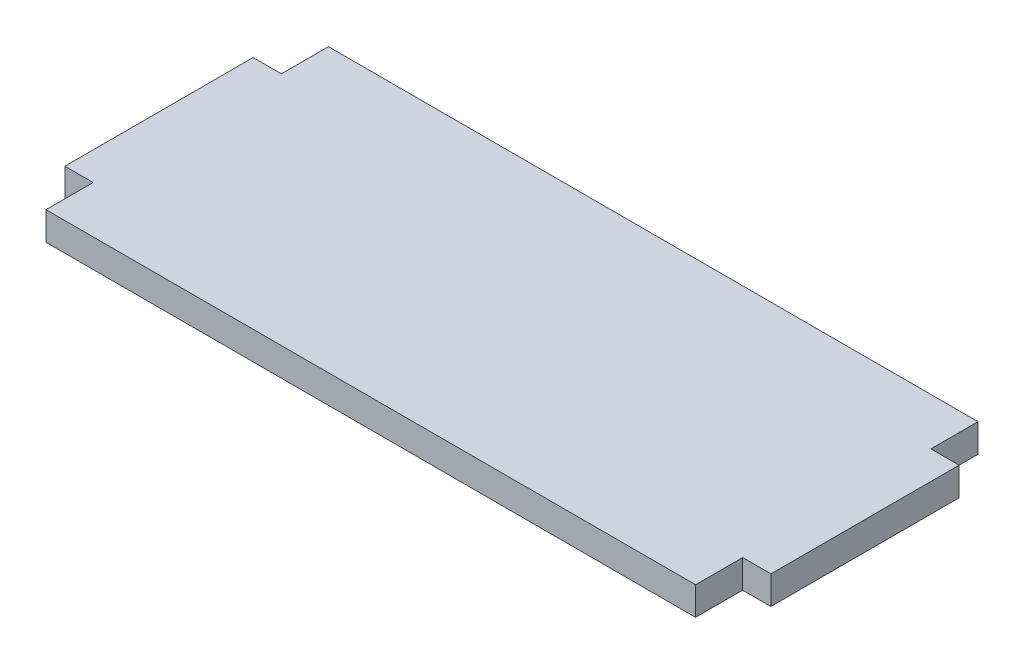
ISO-10303-21;
HEADER;
FILE_DESCRIPTION(('STEP AP214'),'2;1');
FILE_NAME('part.step','',(''),(''),'','','');
FILE_SCHEMA(('AUTOMOTIVE_DESIGN { 1 0 10303 214 1 1 1 1 }'));
ENDSEC;
DATA;
#1=APPLICATION_CONTEXT('core data for automotive mechanical design processes');
#2=APPLICATION_PROTOCOL_DEFINITION('international standard','automotive_design',2000,#1);
#3=PRODUCT_CONTEXT('',#1,'mechanical');
#4=PRODUCT('Part','Part','',(#3));
#5=PRODUCT_RELATED_PRODUCT_CATEGORY('part','',(#4));
#6=PRODUCT_DEFINITION_FORMATION('','',#4);
#7=PRODUCT_DEFINITION_CONTEXT('part definition',#1,'design');
#8=PRODUCT_DEFINITION('design','',#6,#7);
#9=PRODUCT_DEFINITION_SHAPE('','',#8);
#10=(LENGTH_UNIT() NAMED_UNIT(*) SI_UNIT(.MILLI.,.METRE.));
#11=(NAMED_UNIT(*) PLANE_ANGLE_UNIT() SI_UNIT($,.RADIAN.));
#12=(NAMED_UNIT(*) SI_UNIT($,.STERADIAN.) SOLID_ANGLE_UNIT());
#13=UNCERTAINTY_MEASURE_WITH_UNIT(LENGTH_MEASURE(1.E-05),#10,'distance_accuracy_value','');
#14=(GEOMETRIC_REPRESENTATION_CONTEXT(3) GLOBAL_UNCERTAINTY_ASSIGNED_CONTEXT((#13)) GLOBAL_UNIT_ASSIGNED_CONTEXT((#10,
#11,#12)) REPRESENTATION_CONTEXT('',''));
#15=CARTESIAN_POINT('',(0.,0.,0.));
#16=DIRECTION('',(0.,0.,1.));
#17=DIRECTION('',(1.,0.,0.));
#18=AXIS2_PLACEMENT_3D('',#15,#16,#17);
#19=CARTESIAN_POINT('',(69.,3.,-5.));
#20=DIRECTION('',(0.,0.,-1.));
#21=DIRECTION('',(-1.,0.,0.));
#22=AXIS2_PLACEMENT_3D('',#19,#20,#21);
#23=PLANE('',#22);
#24=DIRECTION('',(1.,0.,0.));
#25=VECTOR('',#24,1.);
#26=CARTESIAN_POINT('',(69.,0.,-5.));
#27=LINE('',#26,#25);
#28=CARTESIAN_POINT('',(69.,0.,-5.));
#29=VERTEX_POINT('',#28);
#30=CARTESIAN_POINT('',(72.,0.,-5.));
#31=VERTEX_POINT('',#30);
#32=EDGE_CURVE('E162',#29,#31,#27,.T.);
#33=ORIENTED_EDGE('',*,*,#32,.T.);
#34=DIRECTION('',(0.,-1.,0.));
#35=VECTOR('',#34,1.);
#36=CARTESIAN_POINT('',(72.,3.,-5.));
#37=LINE('',#36,#35);
#38=CARTESIAN_POINT('',(72.,3.,-5.));
#39=VERTEX_POINT('',#38);
#40=EDGE_CURVE('E11',#39,#31,#37,.T.);
#41=ORIENTED_EDGE('',*,*,#40,.F.);
#42=DIRECTION('',(1.,0.,0.));
#43=VECTOR('',#42,1.);
#44=CARTESIAN_POINT('',(69.,3.,-5.));
#45=LINE('',#44,#43);
#46=CARTESIAN_POINT('',(69.,3.,-5.));
#47=VERTEX_POINT('',#46);
#48=EDGE_CURVE('E106',#47,#39,#45,.T.);
#49=ORIENTED_EDGE('',*,*,#48,.F.);
#50=DIRECTION('',(0.,-1.,0.));
#51=VECTOR('',#50,1.);
#52=CARTESIAN_POINT('',(69.,3.,-5.));
#53=LINE('',#52,#51);
#54=EDGE_CURVE('E56',#47,#29,#53,.T.);
#55=ORIENTED_EDGE('',*,*,#54,.T.);
#56=EDGE_LOOP('',(#33,#41,#49,#55));
#57=FACE_BOUND('',#56,.T.);
#58=ADVANCED_FACE('F39',(#57),#23,.F.);
#59=CARTESIAN_POINT('',(72.,3.,-25.));
#60=DIRECTION('',(1.,0.,0.));
#61=DIRECTION('',(0.,0.,-1.));
#62=AXIS2_PLACEMENT_3D('',#59,#60,#61);
#63=PLANE('',#62);
#64=DIRECTION('',(0.,0.,1.));
#65=VECTOR('',#64,1.);
#66=CARTESIAN_POINT('',(72.,0.,-25.));
#67=LINE('',#66,#65);
#68=CARTESIAN_POINT('',(72.,0.,-25.));
#69=VERTEX_POINT('',#68);
#70=EDGE_CURVE('E165',#69,#31,#67,.T.);
#71=ORIENTED_EDGE('',*,*,#70,.F.);
#72=DIRECTION('',(0.,-1.,0.));
#73=VECTOR('',#72,1.);
#74=CARTESIAN_POINT('',(72.,3.,-25.));
#75=LINE('',#74,#73);
#76=CARTESIAN_POINT('',(72.,3.,-25.));
#77=VERTEX_POINT('',#76);
#78=EDGE_CURVE('E48',#77,#69,#75,.T.);
#79=ORIENTED_EDGE('',*,*,#78,.F.);
#80=DIRECTION('',(0.,0.,1.));
#81=VECTOR('',#80,1.);
#82=CARTESIAN_POINT('',(72.,3.,-25.));
#83=LINE('',#82,#81);
#84=EDGE_CURVE('E254',#77,#39,#83,.T.);
#85=ORIENTED_EDGE('',*,*,#84,.T.);
#86=ORIENTED_EDGE('',*,*,#40,.T.);
#87=EDGE_LOOP('',(#71,#79,#85,#86));
#88=FACE_BOUND('',#87,.T.);
#89=ADVANCED_FACE('F239',(#88),#63,.T.);
#90=CARTESIAN_POINT('',(69.,3.,-25.));
#91=DIRECTION('',(0.,0.,-1.));
#92=DIRECTION('',(-1.,0.,0.));
#93=AXIS2_PLACEMENT_3D('',#90,#91,#92);
#94=PLANE('',#93);
#95=DIRECTION('',(1.,0.,0.));
#96=VECTOR('',#95,1.);
#97=CARTESIAN_POINT('',(69.,0.,-25.));
#98=LINE('',#97,#96);
#99=CARTESIAN_POINT('',(69.,0.,-25.));
#100=VERTEX_POINT('',#99);
#101=EDGE_CURVE('E169',#100,#69,#98,.T.);
#102=ORIENTED_EDGE('',*,*,#101,.F.);
#103=DIRECTION('',(0.,-1.,0.));
#104=VECTOR('',#103,1.);
#105=CARTESIAN_POINT('',(69.,3.,-25.));
#106=LINE('',#105,#104);
#107=CARTESIAN_POINT('',(69.,3.,-25.));
#108=VERTEX_POINT('',#107);
#109=EDGE_CURVE('E227',#108,#100,#106,.T.);
#110=ORIENTED_EDGE('',*,*,#109,.F.);
#111=DIRECTION('',(1.,0.,0.));
#112=VECTOR('',#111,1.);
#113=CARTESIAN_POINT('',(69.,3.,-25.));
#114=LINE('',#113,#112);
#115=EDGE_CURVE('E236',#108,#77,#114,.T.);
#116=ORIENTED_EDGE('',*,*,#115,.T.);
#117=ORIENTED_EDGE('',*,*,#78,.T.);
#118=EDGE_LOOP('',(#102,#110,#116,#117));
#119=FACE_BOUND('',#118,.T.);
#120=ADVANCED_FACE('F234',(#119),#94,.T.);
#121=CARTESIAN_POINT('',(69.,3.,-25.));
#122=DIRECTION('',(-1.,0.,0.));
#123=DIRECTION('',(0.,0.,1.));
#124=AXIS2_PLACEMENT_3D('',#121,#122,#123);
#125=PLANE('',#124);
#126=DIRECTION('',(0.,0.,-1.));
#127=VECTOR('',#126,1.);
#128=CARTESIAN_POINT('',(69.,0.,-25.));
#129=LINE('',#128,#127);
#130=CARTESIAN_POINT('',(69.,0.,-30.));
#131=VERTEX_POINT('',#130);
#132=EDGE_CURVE('E173',#100,#131,#129,.T.);
#133=ORIENTED_EDGE('',*,*,#132,.T.);
#134=DIRECTION('',(0.,-1.,0.));
#135=VECTOR('',#134,1.);
#136=CARTESIAN_POINT('',(69.,3.,-30.));
#137=LINE('',#136,#135);
#138=CARTESIAN_POINT('',(69.,3.,-30.));
#139=VERTEX_POINT('',#138);
#140=EDGE_CURVE('E224',#139,#131,#137,.T.);
#141=ORIENTED_EDGE('',*,*,#140,.F.);
#142=DIRECTION('',(0.,0.,-1.));
#143=VECTOR('',#142,1.);
#144=CARTESIAN_POINT('',(69.,3.,-25.));
#145=LINE('',#144,#143);
#146=EDGE_CURVE('E249',#108,#139,#145,.T.);
#147=ORIENTED_EDGE('',*,*,#146,.F.);
#148=ORIENTED_EDGE('',*,*,#109,.T.);
#149=EDGE_LOOP('',(#133,#141,#147,#148));
#150=FACE_BOUND('',#149,.T.);
#151=ADVANCED_FACE('F246',(#150),#125,.F.);
#152=CARTESIAN_POINT('',(0.,3.,-30.));
#153=DIRECTION('',(0.,0.,-1.));
#154=DIRECTION('',(-1.,0.,0.));
#155=AXIS2_PLACEMENT_3D('',#152,#153,#154);
#156=PLANE('',#155);
#157=DIRECTION('',(1.,0.,0.));
#158=VECTOR('',#157,1.);
#159=CARTESIAN_POINT('',(0.,0.,-30.));
#160=LINE('',#159,#158);
#161=CARTESIAN_POINT('',(0.,0.,-30.));
#162=VERTEX_POINT('',#161);
#163=EDGE_CURVE('E177',#162,#131,#160,.T.);
#164=ORIENTED_EDGE('',*,*,#163,.F.);
#165=DIRECTION('',(0.,-1.,0.));
#166=VECTOR('',#165,1.);
#167=CARTESIAN_POINT('',(0.,3.,-30.));
#168=LINE('',#167,#166);
#169=CARTESIAN_POINT('',(0.,3.,-30.));
#170=VERTEX_POINT('',#169);
#171=EDGE_CURVE('E221',#170,#162,#168,.T.);
#172=ORIENTED_EDGE('',*,*,#171,.F.);
#173=DIRECTION('',(1.,0.,0.));
#174=VECTOR('',#173,1.);
#175=CARTESIAN_POINT('',(0.,3.,-30.));
#176=LINE('',#175,#174);
#177=EDGE_CURVE('E252',#170,#139,#176,.T.);
#178=ORIENTED_EDGE('',*,*,#177,.T.);
#179=ORIENTED_EDGE('',*,*,#140,.T.);
#180=EDGE_LOOP('',(#164,#172,#178,#179));
#181=FACE_BOUND('',#180,.T.);
#182=ADVANCED_FACE('F300',(#181),#156,.T.);
#183=CARTESIAN_POINT('',(0.,3.,-25.));
#184=DIRECTION('',(-1.,0.,0.));
#185=DIRECTION('',(0.,0.,1.));
#186=AXIS2_PLACEMENT_3D('',#183,#184,#185);
#187=PLANE('',#186);
#188=DIRECTION('',(0.,0.,-1.));
#189=VECTOR('',#188,1.);
#190=CARTESIAN_POINT('',(0.,0.,-25.));
#191=LINE('',#190,#189);
#192=CARTESIAN_POINT('',(0.,0.,-25.));
#193=VERTEX_POINT('',#192);
#194=EDGE_CURVE('E181',#193,#162,#191,.T.);
#195=ORIENTED_EDGE('',*,*,#194,.F.);
#196=DIRECTION('',(0.,-1.,0.));
#197=VECTOR('',#196,1.);
#198=CARTESIAN_POINT('',(0.,3.,-25.));
#199=LINE('',#198,#197);
#200=CARTESIAN_POINT('',(0.,3.,-25.));
#201=VERTEX_POINT('',#200);
#202=EDGE_CURVE('E218',#201,#193,#199,.T.);
#203=ORIENTED_EDGE('',*,*,#202,.F.);
#204=DIRECTION('',(0.,0.,-1.));
#205=VECTOR('',#204,1.);
#206=CARTESIAN_POINT('',(0.,3.,-25.));
#207=LINE('',#206,#205);
#208=EDGE_CURVE('E263',#201,#170,#207,.T.);
#209=ORIENTED_EDGE('',*,*,#208,.T.);
#210=ORIENTED_EDGE('',*,*,#171,.T.);
#211=EDGE_LOOP('',(#195,#203,#209,#210));
#212=FACE_BOUND('',#211,.T.);
#213=ADVANCED_FACE('F303',(#212),#187,.T.);
#214=CARTESIAN_POINT('',(0.,3.,-25.));
#215=DIRECTION('',(0.,0.,1.));
#216=DIRECTION('',(1.,0.,0.));
#217=AXIS2_PLACEMENT_3D('',#214,#215,#216);
#218=PLANE('',#217);
#219=DIRECTION('',(-1.,0.,0.));
#220=VECTOR('',#219,1.);
#221=CARTESIAN_POINT('',(0.,0.,-25.));
#222=LINE('',#221,#220);
#223=CARTESIAN_POINT('',(-3.,0.,-25.));
#224=VERTEX_POINT('',#223);
#225=EDGE_CURVE('E185',#193,#224,#222,.T.);
#226=ORIENTED_EDGE('',*,*,#225,.T.);
#227=DIRECTION('',(0.,-1.,0.));
#228=VECTOR('',#227,1.);
#229=CARTESIAN_POINT('',(-3.,3.,-25.));
#230=LINE('',#229,#228);
#231=CARTESIAN_POINT('',(-3.,3.,-25.));
#232=VERTEX_POINT('',#231);
#233=EDGE_CURVE('E214',#232,#224,#230,.T.);
#234=ORIENTED_EDGE('',*,*,#233,.F.);
#235=DIRECTION('',(-1.,0.,0.));
#236=VECTOR('',#235,1.);
#237=CARTESIAN_POINT('',(0.,3.,-25.));
#238=LINE('',#237,#236);
#239=EDGE_CURVE('E267',#201,#232,#238,.T.);
#240=ORIENTED_EDGE('',*,*,#239,.F.);
#241=ORIENTED_EDGE('',*,*,#202,.T.);
#242=EDGE_LOOP('',(#226,#234,#240,#241));
#243=FACE_BOUND('',#242,.T.);
#244=ADVANCED_FACE('F307',(#243),#218,.F.);
#245=CARTESIAN_POINT('',(-3.,3.,-25.));
#246=DIRECTION('',(1.,0.,0.));
#247=DIRECTION('',(0.,0.,-1.));
#248=AXIS2_PLACEMENT_3D('',#245,#246,#247);
#249=PLANE('',#248);
#250=DIRECTION('',(0.,0.,1.));
#251=VECTOR('',#250,1.);
#252=CARTESIAN_POINT('',(-3.,0.,-25.));
#253=LINE('',#252,#251);
#254=CARTESIAN_POINT('',(-3.,0.,-5.));
#255=VERTEX_POINT('',#254);
#256=EDGE_CURVE('E188',#224,#255,#253,.T.);
#257=ORIENTED_EDGE('',*,*,#256,.T.);
#258=DIRECTION('',(0.,-1.,0.));
#259=VECTOR('',#258,1.);
#260=CARTESIAN_POINT('',(-3.,3.,-5.));
#261=LINE('',#260,#259);
#262=CARTESIAN_POINT('',(-3.,3.,-5.));
#263=VERTEX_POINT('',#262);
#264=EDGE_CURVE('E211',#263,#255,#261,.T.);
#265=ORIENTED_EDGE('',*,*,#264,.F.);
#266=DIRECTION('',(0.,0.,1.));
#267=VECTOR('',#266,1.);
#268=CARTESIAN_POINT('',(-3.,3.,-25.));
#269=LINE('',#268,#267);
#270=EDGE_CURVE('E270',#232,#263,#269,.T.);
#271=ORIENTED_EDGE('',*,*,#270,.F.);
#272=ORIENTED_EDGE('',*,*,#233,.T.);
#273=EDGE_LOOP('',(#257,#265,#271,#272));
#274=FACE_BOUND('',#273,.T.);
#275=ADVANCED_FACE('F311',(#274),#249,.F.);
#276=CARTESIAN_POINT('',(0.,3.,-5.));
#277=DIRECTION('',(0.,0.,1.));
#278=DIRECTION('',(1.,0.,0.));
#279=AXIS2_PLACEMENT_3D('',#276,#277,#278);
#280=PLANE('',#279);
#281=DIRECTION('',(-1.,0.,0.));
#282=VECTOR('',#281,1.);
#283=CARTESIAN_POINT('',(0.,0.,-5.));
#284=LINE('',#283,#282);
#285=CARTESIAN_POINT('',(0.,0.,-5.));
#286=VERTEX_POINT('',#285);
#287=EDGE_CURVE('E192',#286,#255,#284,.T.);
#288=ORIENTED_EDGE('',*,*,#287,.F.);
#289=DIRECTION('',(0.,-1.,0.));
#290=VECTOR('',#289,1.);
#291=CARTESIAN_POINT('',(0.,3.,-5.));
#292=LINE('',#291,#290);
#293=CARTESIAN_POINT('',(0.,3.,-5.));
#294=VERTEX_POINT('',#293);
#295=EDGE_CURVE('E152',#294,#286,#292,.T.);
#296=ORIENTED_EDGE('',*,*,#295,.F.);
#297=DIRECTION('',(-1.,0.,0.));
#298=VECTOR('',#297,1.);
#299=CARTESIAN_POINT('',(0.,3.,-5.));
#300=LINE('',#299,#298);
#301=EDGE_CURVE('E140',#294,#263,#300,.T.);
#302=ORIENTED_EDGE('',*,*,#301,.T.);
#303=ORIENTED_EDGE('',*,*,#264,.T.);
#304=EDGE_LOOP('',(#288,#296,#302,#303));
#305=FACE_BOUND('',#304,.T.);
#306=ADVANCED_FACE('F275',(#305),#280,.T.);
#307=CARTESIAN_POINT('',(0.,3.,-5.));
#308=DIRECTION('',(1.,0.,0.));
#309=DIRECTION('',(0.,0.,-1.));
#310=AXIS2_PLACEMENT_3D('',#307,#308,#309);
#311=PLANE('',#310);
#312=DIRECTION('',(0.,0.,1.));
#313=VECTOR('',#312,1.);
#314=CARTESIAN_POINT('',(0.,0.,-5.));
#315=LINE('',#314,#313);
#316=CARTESIAN_POINT('',(0.,0.,0.));
#317=VERTEX_POINT('',#316);
#318=EDGE_CURVE('E148',#286,#317,#315,.T.);
#319=ORIENTED_EDGE('',*,*,#318,.T.);
#320=DIRECTION('',(0.,-1.,0.));
#321=VECTOR('',#320,1.);
#322=CARTESIAN_POINT('',(0.,3.,0.));
#323=LINE('',#322,#321);
#324=CARTESIAN_POINT('',(0.,3.,0.));
#325=VERTEX_POINT('',#324);
#326=EDGE_CURVE('E145',#325,#317,#323,.T.);
#327=ORIENTED_EDGE('',*,*,#326,.F.);
#328=DIRECTION('',(0.,0.,1.));
#329=VECTOR('',#328,1.);
#330=CARTESIAN_POINT('',(0.,3.,-5.));
#331=LINE('',#330,#329);
#332=EDGE_CURVE('E134',#294,#325,#331,.T.);
#333=ORIENTED_EDGE('',*,*,#332,.F.);
#334=ORIENTED_EDGE('',*,*,#295,.T.);
#335=EDGE_LOOP('',(#319,#327,#333,#334));
#336=FACE_BOUND('',#335,.T.);
#337=ADVANCED_FACE('F146',(#336),#311,.F.);
#338=CARTESIAN_POINT('',(0.,3.,0.));
#339=DIRECTION('',(0.,0.,-1.));
#340=DIRECTION('',(-1.,0.,0.));
#341=AXIS2_PLACEMENT_3D('',#338,#339,#340);
#342=PLANE('',#341);
#343=DIRECTION('',(1.,0.,0.));
#344=VECTOR('',#343,1.);
#345=CARTESIAN_POINT('',(0.,0.,0.));
#346=LINE('',#345,#344);
#347=CARTESIAN_POINT('',(69.,0.,0.));
#348=VERTEX_POINT('',#347);
#349=EDGE_CURVE('E198',#317,#348,#346,.T.);
#350=ORIENTED_EDGE('',*,*,#349,.T.);
#351=DIRECTION('',(0.,-1.,0.));
#352=VECTOR('',#351,1.);
#353=CARTESIAN_POINT('',(69.,3.,0.));
#354=LINE('',#353,#352);
#355=CARTESIAN_POINT('',(69.,3.,0.));
#356=VERTEX_POINT('',#355);
#357=EDGE_CURVE('E94',#356,#348,#354,.T.);
#358=ORIENTED_EDGE('',*,*,#357,.F.);
#359=DIRECTION('',(1.,0.,0.));
#360=VECTOR('',#359,1.);
#361=CARTESIAN_POINT('',(0.,3.,0.));
#362=LINE('',#361,#360);
#363=EDGE_CURVE('E138',#325,#356,#362,.T.);
#364=ORIENTED_EDGE('',*,*,#363,.F.);
#365=ORIENTED_EDGE('',*,*,#326,.T.);
#366=EDGE_LOOP('',(#350,#358,#364,#365));
#367=FACE_BOUND('',#366,.T.);
#368=ADVANCED_FACE('F154',(#367),#342,.F.);
#369=CARTESIAN_POINT('',(69.,3.,-5.));
#370=DIRECTION('',(1.,0.,0.));
#371=DIRECTION('',(0.,0.,-1.));
#372=AXIS2_PLACEMENT_3D('',#369,#370,#371);
#373=PLANE('',#372);
#374=DIRECTION('',(0.,0.,1.));
#375=VECTOR('',#374,1.);
#376=CARTESIAN_POINT('',(69.,0.,-5.));
#377=LINE('',#376,#375);
#378=EDGE_CURVE('E201',#29,#348,#377,.T.);
#379=ORIENTED_EDGE('',*,*,#378,.F.);
#380=ORIENTED_EDGE('',*,*,#54,.F.);
#381=DIRECTION('',(0.,0.,1.));
#382=VECTOR('',#381,1.);
#383=CARTESIAN_POINT('',(69.,3.,-5.));
#384=LINE('',#383,#382);
#385=EDGE_CURVE('E156',#47,#356,#384,.T.);
#386=ORIENTED_EDGE('',*,*,#385,.T.);
#387=ORIENTED_EDGE('',*,*,#357,.T.);
#388=EDGE_LOOP('',(#379,#380,#386,#387));
#389=FACE_BOUND('',#388,.T.);
#390=ADVANCED_FACE('F278',(#389),#373,.T.);
#391=CARTESIAN_POINT('',(0.,3.,0.));
#392=DIRECTION('',(0.,-1.,0.));
#393=DIRECTION('',(0.,0.,-1.));
#394=AXIS2_PLACEMENT_3D('',#391,#392,#393);
#395=PLANE('',#394);
#396=ORIENTED_EDGE('',*,*,#48,.T.);
#397=ORIENTED_EDGE('',*,*,#84,.F.);
#398=ORIENTED_EDGE('',*,*,#115,.F.);
#399=ORIENTED_EDGE('',*,*,#146,.T.);
#400=ORIENTED_EDGE('',*,*,#177,.F.);
#401=ORIENTED_EDGE('',*,*,#208,.F.);
#402=ORIENTED_EDGE('',*,*,#239,.T.);
#403=ORIENTED_EDGE('',*,*,#270,.T.);
#404=ORIENTED_EDGE('',*,*,#301,.F.);
#405=ORIENTED_EDGE('',*,*,#332,.T.);
#406=ORIENTED_EDGE('',*,*,#363,.T.);
#407=ORIENTED_EDGE('',*,*,#385,.F.);
#408=EDGE_LOOP('',(#396,#397,#398,#399,#400,#401,#402,#403,#404,#405,#406,#407));
#409=FACE_BOUND('',#408,.T.);
#410=ADVANCED_FACE('F136',(#409),#395,.F.);
#411=CARTESIAN_POINT('',(0.,0.,0.));
#412=DIRECTION('',(0.,-1.,0.));
#413=DIRECTION('',(0.,0.,-1.));
#414=AXIS2_PLACEMENT_3D('',#411,#412,#413);
#415=PLANE('',#414);
#416=ORIENTED_EDGE('',*,*,#32,.F.);
#417=ORIENTED_EDGE('',*,*,#378,.T.);
#418=ORIENTED_EDGE('',*,*,#349,.F.);
#419=ORIENTED_EDGE('',*,*,#318,.F.);
#420=ORIENTED_EDGE('',*,*,#287,.T.);
#421=ORIENTED_EDGE('',*,*,#256,.F.);
#422=ORIENTED_EDGE('',*,*,#225,.F.);
#423=ORIENTED_EDGE('',*,*,#194,.T.);
#424=ORIENTED_EDGE('',*,*,#163,.T.);
#425=ORIENTED_EDGE('',*,*,#132,.F.);
#426=ORIENTED_EDGE('',*,*,#101,.T.);
#427=ORIENTED_EDGE('',*,*,#70,.T.);
#428=EDGE_LOOP('',(#416,#417,#418,#419,#420,#421,#422,#423,#424,#425,#426,#427));
#429=FACE_BOUND('',#428,.T.);
#430=ADVANCED_FACE('F242',(#429),#415,.T.);
#431=CLOSED_SHELL('',(#58,#89,#120,#151,#182,#213,#244,#275,#306,#337,#368,#390,#410,#430));
#432=MANIFOLD_SOLID_BREP('B2',#431);
#433=ADVANCED_BREP_SHAPE_REPRESENTATION('',(#18,#432),#14);
#434=SHAPE_DEFINITION_REPRESENTATION(#9,#433);
ENDSEC;
END-ISO-10303-21;
